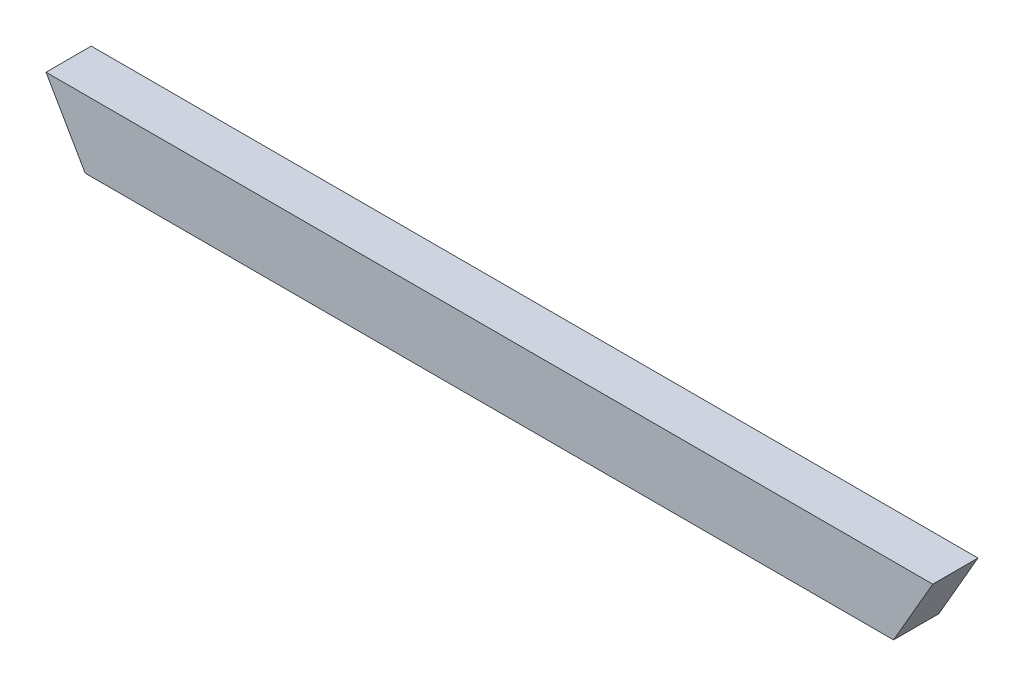
ISO-10303-21;
HEADER;
FILE_DESCRIPTION(('STEP AP214'),'2;1');
FILE_NAME('part.step','',(''),(''),'','','');
FILE_SCHEMA(('AUTOMOTIVE_DESIGN { 1 0 10303 214 1 1 1 1 }'));
ENDSEC;
DATA;
#1=APPLICATION_CONTEXT('core data for automotive mechanical design processes');
#2=APPLICATION_PROTOCOL_DEFINITION('international standard','automotive_design',2000,#1);
#3=PRODUCT_CONTEXT('',#1,'mechanical');
#4=PRODUCT('Part','Part','',(#3));
#5=PRODUCT_RELATED_PRODUCT_CATEGORY('part','',(#4));
#6=PRODUCT_DEFINITION_FORMATION('','',#4);
#7=PRODUCT_DEFINITION_CONTEXT('part definition',#1,'design');
#8=PRODUCT_DEFINITION('design','',#6,#7);
#9=PRODUCT_DEFINITION_SHAPE('','',#8);
#10=(LENGTH_UNIT() NAMED_UNIT(*) SI_UNIT(.MILLI.,.METRE.));
#11=(NAMED_UNIT(*) PLANE_ANGLE_UNIT() SI_UNIT($,.RADIAN.));
#12=(NAMED_UNIT(*) SI_UNIT($,.STERADIAN.) SOLID_ANGLE_UNIT());
#13=UNCERTAINTY_MEASURE_WITH_UNIT(LENGTH_MEASURE(1.E-05),#10,'distance_accuracy_value','');
#14=(GEOMETRIC_REPRESENTATION_CONTEXT(3) GLOBAL_UNCERTAINTY_ASSIGNED_CONTEXT((#13)) GLOBAL_UNIT_ASSIGNED_CONTEXT((#10,
#11,#12)) REPRESENTATION_CONTEXT('',''));
#15=CARTESIAN_POINT('',(0.,0.,0.));
#16=DIRECTION('',(0.,0.,1.));
#17=DIRECTION('',(1.,0.,0.));
#18=AXIS2_PLACEMENT_3D('',#15,#16,#17);
#19=CARTESIAN_POINT('',(-237.869635209938,19.05,25.4));
#20=DIRECTION('',(0.,-1.,0.));
#21=DIRECTION('',(0.,0.,-1.));
#22=AXIS2_PLACEMENT_3D('',#19,#20,#21);
#23=PLANE('',#22);
#24=DIRECTION('',(-1.,0.,0.));
#25=VECTOR('',#24,1.);
#26=CARTESIAN_POINT('',(-237.869635209938,19.05,0.));
#27=LINE('',#26,#25);
#28=CARTESIAN_POINT('',(259.866680466062,19.05,0.));
#29=VERTEX_POINT('',#28);
#30=CARTESIAN_POINT('',(-237.869635209938,19.05,0.));
#31=VERTEX_POINT('',#30);
#32=EDGE_CURVE('E89',#29,#31,#27,.T.);
#33=ORIENTED_EDGE('',*,*,#32,.T.);
#34=DIRECTION('',(0.,0.,-1.));
#35=VECTOR('',#34,1.);
#36=CARTESIAN_POINT('',(-237.869635209938,19.05,25.4));
#37=LINE('',#36,#35);
#38=CARTESIAN_POINT('',(-237.869635209938,19.05,25.4));
#39=VERTEX_POINT('',#38);
#40=EDGE_CURVE('E43',#39,#31,#37,.T.);
#41=ORIENTED_EDGE('',*,*,#40,.F.);
#42=DIRECTION('',(-1.,0.,0.));
#43=VECTOR('',#42,1.);
#44=CARTESIAN_POINT('',(-237.869635209938,19.05,25.4));
#45=LINE('',#44,#43);
#46=CARTESIAN_POINT('',(259.866680466062,19.05,25.4));
#47=VERTEX_POINT('',#46);
#48=EDGE_CURVE('E82',#47,#39,#45,.T.);
#49=ORIENTED_EDGE('',*,*,#48,.F.);
#50=DIRECTION('',(0.,0.,-1.));
#51=VECTOR('',#50,1.);
#52=CARTESIAN_POINT('',(259.866680466062,19.05,25.4));
#53=LINE('',#52,#51);
#54=EDGE_CURVE('E11',#47,#29,#53,.T.);
#55=ORIENTED_EDGE('',*,*,#54,.T.);
#56=EDGE_LOOP('',(#33,#41,#49,#55));
#57=FACE_BOUND('',#56,.T.);
#58=ADVANCED_FACE('F35',(#57),#23,.F.);
#59=CARTESIAN_POINT('',(-237.869635209938,19.05,25.4));
#60=DIRECTION('',(0.86602540378444,0.499999999999998,0.));
#61=DIRECTION('',(-0.499999999999998,0.86602540378444,0.));
#62=AXIS2_PLACEMENT_3D('',#59,#60,#61);
#63=PLANE('',#62);
#64=DIRECTION('',(0.499999999999998,-0.86602540378444,0.));
#65=VECTOR('',#64,1.);
#66=CARTESIAN_POINT('',(-237.869635209938,19.05,0.));
#67=LINE('',#66,#65);
#68=CARTESIAN_POINT('',(-215.872589953813,-19.05,0.));
#69=VERTEX_POINT('',#68);
#70=EDGE_CURVE('E69',#31,#69,#67,.T.);
#71=ORIENTED_EDGE('',*,*,#70,.T.);
#72=DIRECTION('',(0.,0.,-1.));
#73=VECTOR('',#72,1.);
#74=CARTESIAN_POINT('',(-215.872589953813,-19.05,25.4));
#75=LINE('',#74,#73);
#76=CARTESIAN_POINT('',(-215.872589953813,-19.05,25.4));
#77=VERTEX_POINT('',#76);
#78=EDGE_CURVE('E90',#77,#69,#75,.T.);
#79=ORIENTED_EDGE('',*,*,#78,.F.);
#80=DIRECTION('',(0.499999999999998,-0.86602540378444,0.));
#81=VECTOR('',#80,1.);
#82=CARTESIAN_POINT('',(-237.869635209938,19.05,25.4));
#83=LINE('',#82,#81);
#84=EDGE_CURVE('E86',#39,#77,#83,.T.);
#85=ORIENTED_EDGE('',*,*,#84,.F.);
#86=ORIENTED_EDGE('',*,*,#40,.T.);
#87=EDGE_LOOP('',(#71,#79,#85,#86));
#88=FACE_BOUND('',#87,.T.);
#89=ADVANCED_FACE('F91',(#88),#63,.F.);
#90=CARTESIAN_POINT('',(-215.872589953813,-19.05,25.4));
#91=DIRECTION('',(0.,1.,0.));
#92=DIRECTION('',(-1.,0.,0.));
#93=AXIS2_PLACEMENT_3D('',#90,#91,#92);
#94=PLANE('',#93);
#95=DIRECTION('',(1.,0.,0.));
#96=VECTOR('',#95,1.);
#97=CARTESIAN_POINT('',(-215.872589953813,-19.05,0.));
#98=LINE('',#97,#96);
#99=CARTESIAN_POINT('',(237.869635209938,-19.05,0.));
#100=VERTEX_POINT('',#99);
#101=EDGE_CURVE('E76',#69,#100,#98,.T.);
#102=ORIENTED_EDGE('',*,*,#101,.T.);
#103=DIRECTION('',(0.,0.,-1.));
#104=VECTOR('',#103,1.);
#105=CARTESIAN_POINT('',(237.869635209938,-19.05,25.4));
#106=LINE('',#105,#104);
#107=CARTESIAN_POINT('',(237.869635209938,-19.05,25.4));
#108=VERTEX_POINT('',#107);
#109=EDGE_CURVE('E95',#108,#100,#106,.T.);
#110=ORIENTED_EDGE('',*,*,#109,.F.);
#111=DIRECTION('',(1.,0.,0.));
#112=VECTOR('',#111,1.);
#113=CARTESIAN_POINT('',(-215.872589953813,-19.05,25.4));
#114=LINE('',#113,#112);
#115=EDGE_CURVE('E93',#77,#108,#114,.T.);
#116=ORIENTED_EDGE('',*,*,#115,.F.);
#117=ORIENTED_EDGE('',*,*,#78,.T.);
#118=EDGE_LOOP('',(#102,#110,#116,#117));
#119=FACE_BOUND('',#118,.T.);
#120=ADVANCED_FACE('F105',(#119),#94,.F.);
#121=CARTESIAN_POINT('',(248.868157838,0.,25.4));
#122=DIRECTION('',(-0.866025403784444,0.499999999999991,0.));
#123=DIRECTION('',(-0.499999999999991,-0.866025403784444,0.));
#124=AXIS2_PLACEMENT_3D('',#121,#122,#123);
#125=PLANE('',#124);
#126=DIRECTION('',(0.499999999999991,0.866025403784444,0.));
#127=VECTOR('',#126,1.);
#128=CARTESIAN_POINT('',(248.868157838,0.,0.));
#129=LINE('',#128,#127);
#130=EDGE_CURVE('E102',#100,#29,#129,.T.);
#131=ORIENTED_EDGE('',*,*,#130,.T.);
#132=ORIENTED_EDGE('',*,*,#54,.F.);
#133=DIRECTION('',(0.499999999999991,0.866025403784444,0.));
#134=VECTOR('',#133,1.);
#135=CARTESIAN_POINT('',(248.868157838,0.,25.4));
#136=LINE('',#135,#134);
#137=EDGE_CURVE('E51',#108,#47,#136,.T.);
#138=ORIENTED_EDGE('',*,*,#137,.F.);
#139=ORIENTED_EDGE('',*,*,#109,.T.);
#140=EDGE_LOOP('',(#131,#132,#138,#139));
#141=FACE_BOUND('',#140,.T.);
#142=ADVANCED_FACE('F109',(#141),#125,.F.);
#143=CARTESIAN_POINT('',(0.,0.,25.4));
#144=DIRECTION('',(0.,0.,-1.));
#145=DIRECTION('',(-1.,0.,0.));
#146=AXIS2_PLACEMENT_3D('',#143,#144,#145);
#147=PLANE('',#146);
#148=ORIENTED_EDGE('',*,*,#137,.T.);
#149=ORIENTED_EDGE('',*,*,#48,.T.);
#150=ORIENTED_EDGE('',*,*,#84,.T.);
#151=ORIENTED_EDGE('',*,*,#115,.T.);
#152=EDGE_LOOP('',(#148,#149,#150,#151));
#153=FACE_BOUND('',#152,.T.);
#154=ADVANCED_FACE('F84',(#153),#147,.F.);
#155=CARTESIAN_POINT('',(0.,0.,0.));
#156=DIRECTION('',(0.,0.,-1.));
#157=DIRECTION('',(-1.,0.,0.));
#158=AXIS2_PLACEMENT_3D('',#155,#156,#157);
#159=PLANE('',#158);
#160=ORIENTED_EDGE('',*,*,#32,.F.);
#161=ORIENTED_EDGE('',*,*,#130,.F.);
#162=ORIENTED_EDGE('',*,*,#101,.F.);
#163=ORIENTED_EDGE('',*,*,#70,.F.);
#164=EDGE_LOOP('',(#160,#161,#162,#163));
#165=FACE_BOUND('',#164,.T.);
#166=ADVANCED_FACE('F108',(#165),#159,.T.);
#167=CLOSED_SHELL('',(#58,#89,#120,#142,#154,#166));
#168=MANIFOLD_SOLID_BREP('B2',#167);
#169=ADVANCED_BREP_SHAPE_REPRESENTATION('',(#18,#168),#14);
#170=SHAPE_DEFINITION_REPRESENTATION(#9,#169);
ENDSEC;
END-ISO-10303-21;
